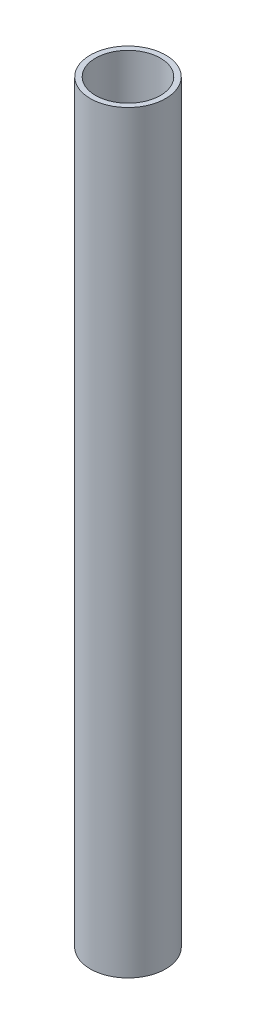
ISO-10303-21;
HEADER;
FILE_DESCRIPTION(('STEP AP214'),'2;1');
FILE_NAME('part.step','',(''),(''),'','','');
FILE_SCHEMA(('AUTOMOTIVE_DESIGN { 1 0 10303 214 1 1 1 1 }'));
ENDSEC;
DATA;
#1=APPLICATION_CONTEXT('core data for automotive mechanical design processes');
#2=APPLICATION_PROTOCOL_DEFINITION('international standard','automotive_design',2000,#1);
#3=PRODUCT_CONTEXT('',#1,'mechanical');
#4=PRODUCT('Part','Part','',(#3));
#5=PRODUCT_RELATED_PRODUCT_CATEGORY('part','',(#4));
#6=PRODUCT_DEFINITION_FORMATION('','',#4);
#7=PRODUCT_DEFINITION_CONTEXT('part definition',#1,'design');
#8=PRODUCT_DEFINITION('design','',#6,#7);
#9=PRODUCT_DEFINITION_SHAPE('','',#8);
#10=(LENGTH_UNIT() NAMED_UNIT(*) SI_UNIT(.MILLI.,.METRE.));
#11=(NAMED_UNIT(*) PLANE_ANGLE_UNIT() SI_UNIT($,.RADIAN.));
#12=(NAMED_UNIT(*) SI_UNIT($,.STERADIAN.) SOLID_ANGLE_UNIT());
#13=UNCERTAINTY_MEASURE_WITH_UNIT(LENGTH_MEASURE(1.E-05),#10,'distance_accuracy_value','');
#14=(GEOMETRIC_REPRESENTATION_CONTEXT(3) GLOBAL_UNCERTAINTY_ASSIGNED_CONTEXT((#13)) GLOBAL_UNIT_ASSIGNED_CONTEXT((#10,
#11,#12)) REPRESENTATION_CONTEXT('',''));
#15=CARTESIAN_POINT('',(0.,0.,0.));
#16=DIRECTION('',(0.,0.,1.));
#17=DIRECTION('',(1.,0.,0.));
#18=AXIS2_PLACEMENT_3D('',#15,#16,#17);
#19=CARTESIAN_POINT('',(0.,500.,0.));
#20=DIRECTION('',(0.,1.,0.));
#21=DIRECTION('',(0.,0.,1.));
#22=AXIS2_PLACEMENT_3D('',#19,#20,#21);
#23=PLANE('',#22);
#24=CARTESIAN_POINT('',(0.,500.,0.));
#25=DIRECTION('',(0.,1.,0.));
#26=DIRECTION('',(0.,0.,1.));
#27=AXIS2_PLACEMENT_3D('',#24,#25,#26);
#28=CIRCLE('',#27,25.);
#29=CARTESIAN_POINT('',(0.,500.,25.));
#30=VERTEX_POINT('',#29);
#31=EDGE_CURVE('E11',#30,#30,#28,.T.);
#32=ORIENTED_EDGE('',*,*,#31,.T.);
#33=EDGE_LOOP('',(#32));
#34=FACE_BOUND('',#33,.T.);
#35=CARTESIAN_POINT('',(0.,500.,0.));
#36=DIRECTION('',(0.,1.,0.));
#37=DIRECTION('',(1.,0.,0.));
#38=AXIS2_PLACEMENT_3D('',#35,#36,#37);
#39=CIRCLE('',#38,21.5);
#40=CARTESIAN_POINT('',(21.5,500.,0.));
#41=VERTEX_POINT('',#40);
#42=EDGE_CURVE('E49',#41,#41,#39,.T.);
#43=ORIENTED_EDGE('',*,*,#42,.F.);
#44=EDGE_LOOP('',(#43));
#45=FACE_BOUND('',#44,.T.);
#46=ADVANCED_FACE('F38',(#34,#45),#23,.T.);
#47=CARTESIAN_POINT('',(0.,0.,0.));
#48=DIRECTION('',(0.,1.,0.));
#49=DIRECTION('',(0.,0.,1.));
#50=AXIS2_PLACEMENT_3D('',#47,#48,#49);
#51=PLANE('',#50);
#52=CARTESIAN_POINT('',(0.,0.,0.));
#53=DIRECTION('',(0.,1.,0.));
#54=DIRECTION('',(0.,0.,1.));
#55=AXIS2_PLACEMENT_3D('',#52,#53,#54);
#56=CIRCLE('',#55,25.);
#57=CARTESIAN_POINT('',(0.,0.,25.));
#58=VERTEX_POINT('',#57);
#59=EDGE_CURVE('E42',#58,#58,#56,.T.);
#60=ORIENTED_EDGE('',*,*,#59,.F.);
#61=EDGE_LOOP('',(#60));
#62=FACE_BOUND('',#61,.T.);
#63=CARTESIAN_POINT('',(0.,0.,0.));
#64=DIRECTION('',(0.,1.,0.));
#65=DIRECTION('',(1.,0.,0.));
#66=AXIS2_PLACEMENT_3D('',#63,#64,#65);
#67=CIRCLE('',#66,21.5);
#68=CARTESIAN_POINT('',(21.5,0.,0.));
#69=VERTEX_POINT('',#68);
#70=EDGE_CURVE('E51',#69,#69,#67,.T.);
#71=ORIENTED_EDGE('',*,*,#70,.T.);
#72=EDGE_LOOP('',(#71));
#73=FACE_BOUND('',#72,.T.);
#74=ADVANCED_FACE('F61',(#62,#73),#51,.F.);
#75=CARTESIAN_POINT('',(0.,500.,0.));
#76=DIRECTION('',(0.,-1.,0.));
#77=DIRECTION('',(0.,0.,-1.));
#78=AXIS2_PLACEMENT_3D('',#75,#76,#77);
#79=CYLINDRICAL_SURFACE('',#78,25.);
#80=ORIENTED_EDGE('',*,*,#31,.F.);
#81=EDGE_LOOP('',(#80));
#82=FACE_BOUND('',#81,.T.);
#83=ORIENTED_EDGE('',*,*,#59,.T.);
#84=EDGE_LOOP('',(#83));
#85=FACE_BOUND('',#84,.T.);
#86=ADVANCED_FACE('F40',(#82,#85),#79,.T.);
#87=CARTESIAN_POINT('',(0.,500.,0.));
#88=DIRECTION('',(0.,-1.,0.));
#89=DIRECTION('',(0.,0.,-1.));
#90=AXIS2_PLACEMENT_3D('',#87,#88,#89);
#91=CYLINDRICAL_SURFACE('',#90,21.5);
#92=ORIENTED_EDGE('',*,*,#42,.T.);
#93=EDGE_LOOP('',(#92));
#94=FACE_BOUND('',#93,.T.);
#95=ORIENTED_EDGE('',*,*,#70,.F.);
#96=EDGE_LOOP('',(#95));
#97=FACE_BOUND('',#96,.T.);
#98=ADVANCED_FACE('F57',(#94,#97),#91,.F.);
#99=CLOSED_SHELL('',(#46,#74,#86,#98));
#100=MANIFOLD_SOLID_BREP('B2',#99);
#101=ADVANCED_BREP_SHAPE_REPRESENTATION('',(#18,#100),#14);
#102=SHAPE_DEFINITION_REPRESENTATION(#9,#101);
ENDSEC;
END-ISO-10303-21;
